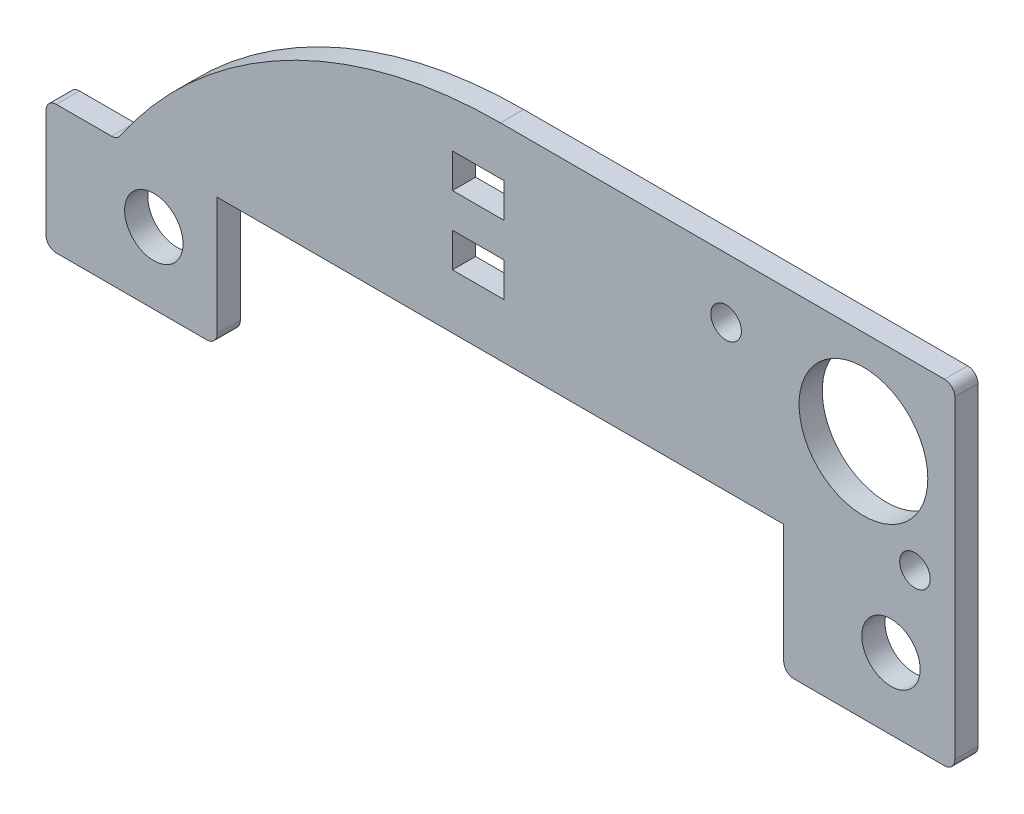
ISO-10303-21;
HEADER;
FILE_DESCRIPTION(('STEP AP214'),'2;1');
FILE_NAME('part.step','',(''),(''),'','','');
FILE_SCHEMA(('AUTOMOTIVE_DESIGN { 1 0 10303 214 1 1 1 1 }'));
ENDSEC;
DATA;
#1=APPLICATION_CONTEXT('core data for automotive mechanical design processes');
#2=APPLICATION_PROTOCOL_DEFINITION('international standard','automotive_design',2000,#1);
#3=PRODUCT_CONTEXT('',#1,'mechanical');
#4=PRODUCT('Part','Part','',(#3));
#5=PRODUCT_RELATED_PRODUCT_CATEGORY('part','',(#4));
#6=PRODUCT_DEFINITION_FORMATION('','',#4);
#7=PRODUCT_DEFINITION_CONTEXT('part definition',#1,'design');
#8=PRODUCT_DEFINITION('design','',#6,#7);
#9=PRODUCT_DEFINITION_SHAPE('','',#8);
#10=(LENGTH_UNIT() NAMED_UNIT(*) SI_UNIT(.MILLI.,.METRE.));
#11=(NAMED_UNIT(*) PLANE_ANGLE_UNIT() SI_UNIT($,.RADIAN.));
#12=(NAMED_UNIT(*) SI_UNIT($,.STERADIAN.) SOLID_ANGLE_UNIT());
#13=UNCERTAINTY_MEASURE_WITH_UNIT(LENGTH_MEASURE(1.E-05),#10,'distance_accuracy_value','');
#14=(GEOMETRIC_REPRESENTATION_CONTEXT(3) GLOBAL_UNCERTAINTY_ASSIGNED_CONTEXT((#13)) GLOBAL_UNIT_ASSIGNED_CONTEXT((#10,
#11,#12)) REPRESENTATION_CONTEXT('',''));
#15=CARTESIAN_POINT('',(0.,0.,0.));
#16=DIRECTION('',(0.,0.,1.));
#17=DIRECTION('',(1.,0.,0.));
#18=AXIS2_PLACEMENT_3D('',#15,#16,#17);
#19=CARTESIAN_POINT('',(-33.613,9.24499999999995,1.7145));
#20=DIRECTION('',(0.,1.,0.));
#21=DIRECTION('',(-1.,0.,0.));
#22=AXIS2_PLACEMENT_3D('',#19,#20,#21);
#23=PLANE('',#22);
#24=DIRECTION('',(1.,0.,0.));
#25=VECTOR('',#24,1.);
#26=CARTESIAN_POINT('',(-33.613,9.24499999999995,0.));
#27=LINE('',#26,#25);
#28=CARTESIAN_POINT('',(-32.851,9.24499999999995,0.));
#29=VERTEX_POINT('',#28);
#30=CARTESIAN_POINT('',(-21.717,9.24499999999995,0.));
#31=VERTEX_POINT('',#30);
#32=EDGE_CURVE('E348',#29,#31,#27,.T.);
#33=ORIENTED_EDGE('',*,*,#32,.T.);
#34=DIRECTION('',(0.,0.,1.));
#35=VECTOR('',#34,1.);
#36=CARTESIAN_POINT('',(-21.717,9.24499999999995,1.7145));
#37=LINE('',#36,#35);
#38=CARTESIAN_POINT('',(-21.717,9.24499999999995,1.7145));
#39=VERTEX_POINT('',#38);
#40=EDGE_CURVE('E389',#31,#39,#37,.T.);
#41=ORIENTED_EDGE('',*,*,#40,.T.);
#42=DIRECTION('',(1.,0.,0.));
#43=VECTOR('',#42,1.);
#44=CARTESIAN_POINT('',(-33.613,9.24499999999995,1.7145));
#45=LINE('',#44,#43);
#46=CARTESIAN_POINT('',(-32.851,9.24499999999995,1.7145));
#47=VERTEX_POINT('',#46);
#48=EDGE_CURVE('E330',#47,#39,#45,.T.);
#49=ORIENTED_EDGE('',*,*,#48,.F.);
#50=DIRECTION('',(0.,0.,-1.));
#51=VECTOR('',#50,1.);
#52=CARTESIAN_POINT('',(-32.851,9.24499999999995,1.7145));
#53=LINE('',#52,#51);
#54=EDGE_CURVE('E386',#47,#29,#53,.T.);
#55=ORIENTED_EDGE('',*,*,#54,.T.);
#56=EDGE_LOOP('',(#33,#41,#49,#55));
#57=FACE_BOUND('',#56,.T.);
#58=ADVANCED_FACE('F33',(#57),#23,.F.);
#59=CARTESIAN_POINT('',(0.,0.,1.7145));
#60=DIRECTION('',(0.,0.,1.));
#61=DIRECTION('',(1.,0.,0.));
#62=AXIS2_PLACEMENT_3D('',#59,#60,#61);
#63=PLANE('',#62);
#64=DIRECTION('',(0.,1.,0.));
#65=VECTOR('',#64,1.);
#66=CARTESIAN_POINT('',(20.955,18.7699999999999,1.7145));
#67=LINE('',#66,#65);
#68=CARTESIAN_POINT('',(20.955,10.0069999999999,1.7145));
#69=VERTEX_POINT('',#68);
#70=CARTESIAN_POINT('',(20.955,18.7699999999999,1.7145));
#71=VERTEX_POINT('',#70);
#72=EDGE_CURVE('E202',#69,#71,#67,.T.);
#73=ORIENTED_EDGE('',*,*,#72,.F.);
#74=CARTESIAN_POINT('',(21.717,10.0069999999999,1.7145));
#75=DIRECTION('',(0.,0.,1.));
#76=DIRECTION('',(1.,0.,0.));
#77=AXIS2_PLACEMENT_3D('',#74,#75,#76);
#78=CIRCLE('',#77,0.762);
#79=CARTESIAN_POINT('',(21.717,9.24499999999995,1.7145));
#80=VERTEX_POINT('',#79);
#81=EDGE_CURVE('E370',#69,#80,#78,.T.);
#82=ORIENTED_EDGE('',*,*,#81,.T.);
#83=CARTESIAN_POINT('',(32.851,9.24499999999995,1.7145));
#84=VERTEX_POINT('',#83);
#85=EDGE_CURVE('E329',#80,#84,#45,.T.);
#86=ORIENTED_EDGE('',*,*,#85,.T.);
#87=CARTESIAN_POINT('',(32.851,10.0069999999999,1.7145));
#88=DIRECTION('',(0.,0.,1.));
#89=DIRECTION('',(1.,0.,0.));
#90=AXIS2_PLACEMENT_3D('',#87,#88,#89);
#91=CIRCLE('',#90,0.762);
#92=CARTESIAN_POINT('',(33.613,10.007,1.7145));
#93=VERTEX_POINT('',#92);
#94=EDGE_CURVE('E364',#84,#93,#91,.T.);
#95=ORIENTED_EDGE('',*,*,#94,.T.);
#96=DIRECTION('',(0.,1.,0.));
#97=VECTOR('',#96,1.);
#98=CARTESIAN_POINT('',(33.613,34.0099999999999,1.7145));
#99=LINE('',#98,#97);
#100=CARTESIAN_POINT('',(33.613,33.2479999999999,1.7145));
#101=VERTEX_POINT('',#100);
#102=EDGE_CURVE('E333',#93,#101,#99,.T.);
#103=ORIENTED_EDGE('',*,*,#102,.T.);
#104=CARTESIAN_POINT('',(32.851,33.2479999999999,1.7145));
#105=DIRECTION('',(0.,0.,1.));
#106=DIRECTION('',(1.,0.,0.));
#107=AXIS2_PLACEMENT_3D('',#104,#105,#106);
#108=CIRCLE('',#107,0.762);
#109=CARTESIAN_POINT('',(32.851,34.0099999999999,1.7145));
#110=VERTEX_POINT('',#109);
#111=EDGE_CURVE('E366',#101,#110,#108,.T.);
#112=ORIENTED_EDGE('',*,*,#111,.T.);
#113=DIRECTION('',(-1.,0.,0.));
#114=VECTOR('',#113,1.);
#115=CARTESIAN_POINT('',(33.613,34.0099999999999,1.7145));
#116=LINE('',#115,#114);
#117=CARTESIAN_POINT('',(0.,34.0099999999999,1.7145));
#118=VERTEX_POINT('',#117);
#119=EDGE_CURVE('E336',#110,#118,#116,.T.);
#120=ORIENTED_EDGE('',*,*,#119,.T.);
#121=CARTESIAN_POINT('',(0.,0.,1.7145));
#122=DIRECTION('',(0.,0.,1.));
#123=DIRECTION('',(1.,0.,0.));
#124=AXIS2_PLACEMENT_3D('',#121,#122,#123);
#125=CIRCLE('',#124,34.0099999999999);
#126=CARTESIAN_POINT('',(-28.1374900737837,19.1039721615092,1.7145));
#127=VERTEX_POINT('',#126);
#128=EDGE_CURVE('E338',#118,#127,#125,.T.);
#129=ORIENTED_EDGE('',*,*,#128,.T.);
#130=CARTESIAN_POINT('',(-28.7679154614998,19.5319999999999,1.7145));
#131=DIRECTION('',(0.,0.,1.));
#132=DIRECTION('',(1.,0.,0.));
#133=AXIS2_PLACEMENT_3D('',#130,#131,#132);
#134=CIRCLE('',#133,0.762);
#135=CARTESIAN_POINT('',(-28.7679154614998,18.7699999999999,1.7145));
#136=VERTEX_POINT('',#135);
#137=EDGE_CURVE('E11',#127,#136,#134,.F.);
#138=ORIENTED_EDGE('',*,*,#137,.T.);
#139=DIRECTION('',(-1.,0.,0.));
#140=VECTOR('',#139,1.);
#141=CARTESIAN_POINT('',(-33.613,18.7699999999999,1.7145));
#142=LINE('',#141,#140);
#143=CARTESIAN_POINT('',(-32.851,18.7699999999999,1.7145));
#144=VERTEX_POINT('',#143);
#145=EDGE_CURVE('E322',#136,#144,#142,.T.);
#146=ORIENTED_EDGE('',*,*,#145,.T.);
#147=CARTESIAN_POINT('',(-32.851,18.0079999999999,1.7145));
#148=DIRECTION('',(0.,0.,1.));
#149=DIRECTION('',(1.,0.,0.));
#150=AXIS2_PLACEMENT_3D('',#147,#148,#149);
#151=CIRCLE('',#150,0.762);
#152=CARTESIAN_POINT('',(-33.613,18.0079999999999,1.7145));
#153=VERTEX_POINT('',#152);
#154=EDGE_CURVE('E360',#144,#153,#151,.T.);
#155=ORIENTED_EDGE('',*,*,#154,.T.);
#156=DIRECTION('',(0.,-1.,0.));
#157=VECTOR('',#156,1.);
#158=CARTESIAN_POINT('',(-33.613,18.7699999999999,1.7145));
#159=LINE('',#158,#157);
#160=CARTESIAN_POINT('',(-33.613,10.0069999999999,1.7145));
#161=VERTEX_POINT('',#160);
#162=EDGE_CURVE('E325',#153,#161,#159,.T.);
#163=ORIENTED_EDGE('',*,*,#162,.T.);
#164=CARTESIAN_POINT('',(-32.851,10.0069999999999,1.7145));
#165=DIRECTION('',(0.,0.,1.));
#166=DIRECTION('',(1.,0.,0.));
#167=AXIS2_PLACEMENT_3D('',#164,#165,#166);
#168=CIRCLE('',#167,0.762);
#169=EDGE_CURVE('E362',#161,#47,#168,.T.);
#170=ORIENTED_EDGE('',*,*,#169,.T.);
#171=ORIENTED_EDGE('',*,*,#48,.T.);
#172=CARTESIAN_POINT('',(-21.717,10.0069999999999,1.7145));
#173=DIRECTION('',(0.,0.,1.));
#174=DIRECTION('',(1.,0.,0.));
#175=AXIS2_PLACEMENT_3D('',#172,#173,#174);
#176=CIRCLE('',#175,0.762);
#177=CARTESIAN_POINT('',(-20.955,10.0069999999999,1.7145));
#178=VERTEX_POINT('',#177);
#179=EDGE_CURVE('E368',#39,#178,#176,.T.);
#180=ORIENTED_EDGE('',*,*,#179,.T.);
#181=DIRECTION('',(0.,-1.,0.));
#182=VECTOR('',#181,1.);
#183=CARTESIAN_POINT('',(-20.955,18.7699999999999,1.7145));
#184=LINE('',#183,#182);
#185=CARTESIAN_POINT('',(-20.955,18.7699999999999,1.7145));
#186=VERTEX_POINT('',#185);
#187=EDGE_CURVE('E213',#186,#178,#184,.T.);
#188=ORIENTED_EDGE('',*,*,#187,.F.);
#189=DIRECTION('',(-1.,0.,0.));
#190=VECTOR('',#189,1.);
#191=CARTESIAN_POINT('',(-20.955,18.7699999999999,1.7145));
#192=LINE('',#191,#190);
#193=EDGE_CURVE('E212',#71,#186,#192,.T.);
#194=ORIENTED_EDGE('',*,*,#193,.F.);
#195=EDGE_LOOP('',(#73,#82,#86,#95,#103,#112,#120,#129,#138,#146,#155,#163,#170,#171,#180,#188,#194));
#196=FACE_BOUND('',#195,.T.);
#197=DIRECTION('',(0.,-1.,0.));
#198=VECTOR('',#197,1.);
#199=CARTESIAN_POINT('',(-3.54914079696229,30.4366725441909,1.7145));
#200=LINE('',#199,#198);
#201=CARTESIAN_POINT('',(-3.54914079696229,30.4366725441909,1.7145));
#202=VERTEX_POINT('',#201);
#203=CARTESIAN_POINT('',(-3.54914079696229,27.8966725441909,1.7145));
#204=VERTEX_POINT('',#203);
#205=EDGE_CURVE('E241',#202,#204,#200,.T.);
#206=ORIENTED_EDGE('',*,*,#205,.F.);
#207=DIRECTION('',(-1.,0.,0.));
#208=VECTOR('',#207,1.);
#209=CARTESIAN_POINT('',(-3.54914079696229,30.4366725441909,1.7145));
#210=LINE('',#209,#208);
#211=CARTESIAN_POINT('',(0.260859203037711,30.4366725441909,1.7145));
#212=VERTEX_POINT('',#211);
#213=EDGE_CURVE('E250',#212,#202,#210,.T.);
#214=ORIENTED_EDGE('',*,*,#213,.F.);
#215=DIRECTION('',(0.,1.,0.));
#216=VECTOR('',#215,1.);
#217=CARTESIAN_POINT('',(0.260859203037711,30.4366725441909,1.7145));
#218=LINE('',#217,#216);
#219=CARTESIAN_POINT('',(0.260859203037709,27.8966725441909,1.7145));
#220=VERTEX_POINT('',#219);
#221=EDGE_CURVE('E247',#220,#212,#218,.T.);
#222=ORIENTED_EDGE('',*,*,#221,.F.);
#223=DIRECTION('',(1.,0.,0.));
#224=VECTOR('',#223,1.);
#225=CARTESIAN_POINT('',(-3.54914079696229,27.8966725441909,1.7145));
#226=LINE('',#225,#224);
#227=EDGE_CURVE('E243',#204,#220,#226,.T.);
#228=ORIENTED_EDGE('',*,*,#227,.F.);
#229=EDGE_LOOP('',(#206,#214,#222,#228));
#230=FACE_BOUND('',#229,.T.);
#231=DIRECTION('',(0.,-1.,0.));
#232=VECTOR('',#231,1.);
#233=CARTESIAN_POINT('',(-3.54914079696229,25.3566725441909,1.7145));
#234=LINE('',#233,#232);
#235=CARTESIAN_POINT('',(-3.54914079696229,25.3566725441909,1.7145));
#236=VERTEX_POINT('',#235);
#237=CARTESIAN_POINT('',(-3.54914079696229,22.8166725441909,1.7145));
#238=VERTEX_POINT('',#237);
#239=EDGE_CURVE('E271',#236,#238,#234,.T.);
#240=ORIENTED_EDGE('',*,*,#239,.F.);
#241=DIRECTION('',(-1.,0.,0.));
#242=VECTOR('',#241,1.);
#243=CARTESIAN_POINT('',(-3.54914079696229,25.3566725441909,1.7145));
#244=LINE('',#243,#242);
#245=CARTESIAN_POINT('',(0.260859203037713,25.3566725441909,1.7145));
#246=VERTEX_POINT('',#245);
#247=EDGE_CURVE('E280',#246,#236,#244,.T.);
#248=ORIENTED_EDGE('',*,*,#247,.F.);
#249=DIRECTION('',(0.,1.,0.));
#250=VECTOR('',#249,1.);
#251=CARTESIAN_POINT('',(0.260859203037713,25.3566725441909,1.7145));
#252=LINE('',#251,#250);
#253=CARTESIAN_POINT('',(0.260859203037712,22.8166725441909,1.7145));
#254=VERTEX_POINT('',#253);
#255=EDGE_CURVE('E277',#254,#246,#252,.T.);
#256=ORIENTED_EDGE('',*,*,#255,.F.);
#257=DIRECTION('',(1.,0.,0.));
#258=VECTOR('',#257,1.);
#259=CARTESIAN_POINT('',(-3.54914079696229,22.8166725441909,1.7145));
#260=LINE('',#259,#258);
#261=EDGE_CURVE('E273',#238,#254,#260,.T.);
#262=ORIENTED_EDGE('',*,*,#261,.F.);
#263=EDGE_LOOP('',(#240,#248,#256,#262));
#264=FACE_BOUND('',#263,.T.);
#265=CARTESIAN_POINT('',(16.6925888348737,29.565,1.7145));
#266=DIRECTION('',(0.,0.,1.));
#267=DIRECTION('',(1.,0.,0.));
#268=AXIS2_PLACEMENT_3D('',#265,#266,#267);
#269=CIRCLE('',#268,1.1303);
#270=CARTESIAN_POINT('',(17.8228888348737,29.565,1.7145));
#271=VERTEX_POINT('',#270);
#272=EDGE_CURVE('E298',#271,#271,#269,.T.);
#273=ORIENTED_EDGE('',*,*,#272,.F.);
#274=EDGE_LOOP('',(#273));
#275=FACE_BOUND('',#274,.T.);
#276=CARTESIAN_POINT('',(28.8886,14.5155,1.7145));
#277=DIRECTION('',(0.,0.,1.));
#278=DIRECTION('',(1.,0.,0.));
#279=AXIS2_PLACEMENT_3D('',#276,#277,#278);
#280=CIRCLE('',#279,2.159);
#281=CARTESIAN_POINT('',(31.0476,14.5155,1.7145));
#282=VERTEX_POINT('',#281);
#283=EDGE_CURVE('E310',#282,#282,#280,.T.);
#284=ORIENTED_EDGE('',*,*,#283,.F.);
#285=EDGE_LOOP('',(#284));
#286=FACE_BOUND('',#285,.T.);
#287=CARTESIAN_POINT('',(-25.6374,14.5154999999999,1.7145));
#288=DIRECTION('',(0.,0.,1.));
#289=DIRECTION('',(1.,0.,0.));
#290=AXIS2_PLACEMENT_3D('',#287,#288,#289);
#291=CIRCLE('',#290,2.159);
#292=CARTESIAN_POINT('',(-23.4784,14.5154999999999,1.7145));
#293=VERTEX_POINT('',#292);
#294=EDGE_CURVE('E316',#293,#293,#291,.T.);
#295=ORIENTED_EDGE('',*,*,#294,.F.);
#296=EDGE_LOOP('',(#295));
#297=FACE_BOUND('',#296,.T.);
#298=CARTESIAN_POINT('',(30.6625888348737,20.675,1.7145));
#299=DIRECTION('',(0.,0.,1.));
#300=DIRECTION('',(1.,0.,0.));
#301=AXIS2_PLACEMENT_3D('',#298,#299,#300);
#302=CIRCLE('',#301,1.13030000000001);
#303=CARTESIAN_POINT('',(31.7928888348737,20.675,1.7145));
#304=VERTEX_POINT('',#303);
#305=EDGE_CURVE('E304',#304,#304,#302,.T.);
#306=ORIENTED_EDGE('',*,*,#305,.F.);
#307=EDGE_LOOP('',(#306));
#308=FACE_BOUND('',#307,.T.);
#309=CARTESIAN_POINT('',(26.8525888348737,27.025,1.7145));
#310=DIRECTION('',(0.,0.,1.));
#311=DIRECTION('',(1.,0.,0.));
#312=AXIS2_PLACEMENT_3D('',#309,#310,#311);
#313=CIRCLE('',#312,4.76250000000001);
#314=CARTESIAN_POINT('',(31.6150888348737,27.025,1.7145));
#315=VERTEX_POINT('',#314);
#316=EDGE_CURVE('E292',#315,#315,#313,.T.);
#317=ORIENTED_EDGE('',*,*,#316,.F.);
#318=EDGE_LOOP('',(#317));
#319=FACE_BOUND('',#318,.T.);
#320=ADVANCED_FACE('F224',(#196,#230,#264,#275,#286,#297,#308,#319),#63,.T.);
#321=CARTESIAN_POINT('',(0.,0.,0.));
#322=DIRECTION('',(0.,0.,1.));
#323=DIRECTION('',(1.,0.,0.));
#324=AXIS2_PLACEMENT_3D('',#321,#322,#323);
#325=PLANE('',#324);
#326=DIRECTION('',(1.,0.,0.));
#327=VECTOR('',#326,1.);
#328=CARTESIAN_POINT('',(-3.54914079696229,30.4366725441909,0.));
#329=LINE('',#328,#327);
#330=CARTESIAN_POINT('',(-3.54914079696229,30.4366725441909,0.));
#331=VERTEX_POINT('',#330);
#332=CARTESIAN_POINT('',(0.260859203037711,30.4366725441909,0.));
#333=VERTEX_POINT('',#332);
#334=EDGE_CURVE('E235',#331,#333,#329,.T.);
#335=ORIENTED_EDGE('',*,*,#334,.F.);
#336=DIRECTION('',(0.,1.,0.));
#337=VECTOR('',#336,1.);
#338=CARTESIAN_POINT('',(-3.54914079696229,30.4366725441909,0.));
#339=LINE('',#338,#337);
#340=CARTESIAN_POINT('',(-3.54914079696229,27.8966725441909,0.));
#341=VERTEX_POINT('',#340);
#342=EDGE_CURVE('E238',#341,#331,#339,.T.);
#343=ORIENTED_EDGE('',*,*,#342,.F.);
#344=DIRECTION('',(-1.,0.,0.));
#345=VECTOR('',#344,1.);
#346=CARTESIAN_POINT('',(-3.54914079696229,27.8966725441909,0.));
#347=LINE('',#346,#345);
#348=CARTESIAN_POINT('',(0.260859203037709,27.8966725441909,0.));
#349=VERTEX_POINT('',#348);
#350=EDGE_CURVE('E240',#349,#341,#347,.T.);
#351=ORIENTED_EDGE('',*,*,#350,.F.);
#352=DIRECTION('',(0.,-1.,0.));
#353=VECTOR('',#352,1.);
#354=CARTESIAN_POINT('',(0.260859203037711,30.4366725441909,0.));
#355=LINE('',#354,#353);
#356=EDGE_CURVE('E232',#333,#349,#355,.T.);
#357=ORIENTED_EDGE('',*,*,#356,.F.);
#358=EDGE_LOOP('',(#335,#343,#351,#357));
#359=FACE_BOUND('',#358,.T.);
#360=DIRECTION('',(1.,0.,0.));
#361=VECTOR('',#360,1.);
#362=CARTESIAN_POINT('',(-3.54914079696229,25.3566725441909,0.));
#363=LINE('',#362,#361);
#364=CARTESIAN_POINT('',(-3.54914079696229,25.3566725441909,0.));
#365=VERTEX_POINT('',#364);
#366=CARTESIAN_POINT('',(0.260859203037713,25.3566725441909,0.));
#367=VERTEX_POINT('',#366);
#368=EDGE_CURVE('E266',#365,#367,#363,.T.);
#369=ORIENTED_EDGE('',*,*,#368,.F.);
#370=DIRECTION('',(0.,1.,0.));
#371=VECTOR('',#370,1.);
#372=CARTESIAN_POINT('',(-3.54914079696229,25.3566725441909,0.));
#373=LINE('',#372,#371);
#374=CARTESIAN_POINT('',(-3.54914079696229,22.8166725441909,0.));
#375=VERTEX_POINT('',#374);
#376=EDGE_CURVE('E269',#375,#365,#373,.T.);
#377=ORIENTED_EDGE('',*,*,#376,.F.);
#378=DIRECTION('',(-1.,0.,0.));
#379=VECTOR('',#378,1.);
#380=CARTESIAN_POINT('',(-3.54914079696229,22.8166725441909,0.));
#381=LINE('',#380,#379);
#382=CARTESIAN_POINT('',(0.260859203037712,22.8166725441909,0.));
#383=VERTEX_POINT('',#382);
#384=EDGE_CURVE('E244',#383,#375,#381,.T.);
#385=ORIENTED_EDGE('',*,*,#384,.F.);
#386=DIRECTION('',(0.,-1.,0.));
#387=VECTOR('',#386,1.);
#388=CARTESIAN_POINT('',(0.260859203037713,25.3566725441909,0.));
#389=LINE('',#388,#387);
#390=EDGE_CURVE('E263',#367,#383,#389,.T.);
#391=ORIENTED_EDGE('',*,*,#390,.F.);
#392=EDGE_LOOP('',(#369,#377,#385,#391));
#393=FACE_BOUND('',#392,.T.);
#394=CARTESIAN_POINT('',(21.717,9.24499999999995,0.));
#395=VERTEX_POINT('',#394);
#396=CARTESIAN_POINT('',(32.851,9.24499999999995,0.));
#397=VERTEX_POINT('',#396);
#398=EDGE_CURVE('E347',#395,#397,#27,.T.);
#399=ORIENTED_EDGE('',*,*,#398,.F.);
#400=CARTESIAN_POINT('',(21.717,10.0069999999999,0.));
#401=DIRECTION('',(0.,0.,1.));
#402=DIRECTION('',(1.,0.,0.));
#403=AXIS2_PLACEMENT_3D('',#400,#401,#402);
#404=CIRCLE('',#403,0.762);
#405=CARTESIAN_POINT('',(20.955,10.0069999999999,0.));
#406=VERTEX_POINT('',#405);
#407=EDGE_CURVE('E384',#395,#406,#404,.F.);
#408=ORIENTED_EDGE('',*,*,#407,.T.);
#409=DIRECTION('',(0.,-1.,0.));
#410=VECTOR('',#409,1.);
#411=CARTESIAN_POINT('',(20.955,18.7699999999999,0.));
#412=LINE('',#411,#410);
#413=CARTESIAN_POINT('',(20.955,18.7699999999999,0.));
#414=VERTEX_POINT('',#413);
#415=EDGE_CURVE('E230',#414,#406,#412,.T.);
#416=ORIENTED_EDGE('',*,*,#415,.F.);
#417=DIRECTION('',(1.,0.,0.));
#418=VECTOR('',#417,1.);
#419=CARTESIAN_POINT('',(-20.955,18.7699999999999,0.));
#420=LINE('',#419,#418);
#421=CARTESIAN_POINT('',(-20.955,18.7699999999999,0.));
#422=VERTEX_POINT('',#421);
#423=EDGE_CURVE('E221',#422,#414,#420,.T.);
#424=ORIENTED_EDGE('',*,*,#423,.F.);
#425=DIRECTION('',(0.,1.,0.));
#426=VECTOR('',#425,1.);
#427=CARTESIAN_POINT('',(-20.955,18.7699999999999,0.));
#428=LINE('',#427,#426);
#429=CARTESIAN_POINT('',(-20.955,10.0069999999999,0.));
#430=VERTEX_POINT('',#429);
#431=EDGE_CURVE('E274',#430,#422,#428,.T.);
#432=ORIENTED_EDGE('',*,*,#431,.F.);
#433=CARTESIAN_POINT('',(-21.717,10.0069999999999,0.));
#434=DIRECTION('',(0.,0.,1.));
#435=DIRECTION('',(1.,0.,0.));
#436=AXIS2_PLACEMENT_3D('',#433,#434,#435);
#437=CIRCLE('',#436,0.762);
#438=EDGE_CURVE('E382',#430,#31,#437,.F.);
#439=ORIENTED_EDGE('',*,*,#438,.T.);
#440=ORIENTED_EDGE('',*,*,#32,.F.);
#441=CARTESIAN_POINT('',(-32.851,10.0069999999999,0.));
#442=DIRECTION('',(0.,0.,1.));
#443=DIRECTION('',(1.,0.,0.));
#444=AXIS2_PLACEMENT_3D('',#441,#442,#443);
#445=CIRCLE('',#444,0.762);
#446=CARTESIAN_POINT('',(-33.613,10.0069999999999,0.));
#447=VERTEX_POINT('',#446);
#448=EDGE_CURVE('E378',#29,#447,#445,.F.);
#449=ORIENTED_EDGE('',*,*,#448,.T.);
#450=DIRECTION('',(0.,-1.,0.));
#451=VECTOR('',#450,1.);
#452=CARTESIAN_POINT('',(-33.613,18.7699999999999,0.));
#453=LINE('',#452,#451);
#454=CARTESIAN_POINT('',(-33.613,18.0079999999999,0.));
#455=VERTEX_POINT('',#454);
#456=EDGE_CURVE('E344',#455,#447,#453,.T.);
#457=ORIENTED_EDGE('',*,*,#456,.F.);
#458=CARTESIAN_POINT('',(-32.851,18.0079999999999,0.));
#459=DIRECTION('',(0.,0.,1.));
#460=DIRECTION('',(1.,0.,0.));
#461=AXIS2_PLACEMENT_3D('',#458,#459,#460);
#462=CIRCLE('',#461,0.762);
#463=CARTESIAN_POINT('',(-32.851,18.7699999999999,0.));
#464=VERTEX_POINT('',#463);
#465=EDGE_CURVE('E376',#455,#464,#462,.F.);
#466=ORIENTED_EDGE('',*,*,#465,.T.);
#467=DIRECTION('',(-1.,0.,0.));
#468=VECTOR('',#467,1.);
#469=CARTESIAN_POINT('',(-33.613,18.7699999999999,0.));
#470=LINE('',#469,#468);
#471=CARTESIAN_POINT('',(-28.7679154614998,18.7699999999999,0.));
#472=VERTEX_POINT('',#471);
#473=EDGE_CURVE('E319',#472,#464,#470,.T.);
#474=ORIENTED_EDGE('',*,*,#473,.F.);
#475=CARTESIAN_POINT('',(-28.7679154614998,19.5319999999999,0.));
#476=DIRECTION('',(0.,0.,1.));
#477=DIRECTION('',(1.,0.,0.));
#478=AXIS2_PLACEMENT_3D('',#475,#476,#477);
#479=CIRCLE('',#478,0.762);
#480=CARTESIAN_POINT('',(-28.1374900737837,19.1039721615092,0.));
#481=VERTEX_POINT('',#480);
#482=EDGE_CURVE('E41',#472,#481,#479,.T.);
#483=ORIENTED_EDGE('',*,*,#482,.T.);
#484=CARTESIAN_POINT('',(0.,0.,0.));
#485=DIRECTION('',(0.,0.,1.));
#486=DIRECTION('',(1.,0.,0.));
#487=AXIS2_PLACEMENT_3D('',#484,#485,#486);
#488=CIRCLE('',#487,34.0099999999999);
#489=CARTESIAN_POINT('',(0.,34.0099999999999,0.));
#490=VERTEX_POINT('',#489);
#491=EDGE_CURVE('E326',#490,#481,#488,.T.);
#492=ORIENTED_EDGE('',*,*,#491,.F.);
#493=DIRECTION('',(-1.,0.,0.));
#494=VECTOR('',#493,1.);
#495=CARTESIAN_POINT('',(33.613,34.0099999999999,0.));
#496=LINE('',#495,#494);
#497=CARTESIAN_POINT('',(32.851,34.0099999999999,0.));
#498=VERTEX_POINT('',#497);
#499=EDGE_CURVE('E353',#498,#490,#496,.T.);
#500=ORIENTED_EDGE('',*,*,#499,.F.);
#501=CARTESIAN_POINT('',(32.851,33.2479999999999,0.));
#502=DIRECTION('',(0.,0.,1.));
#503=DIRECTION('',(1.,0.,0.));
#504=AXIS2_PLACEMENT_3D('',#501,#502,#503);
#505=CIRCLE('',#504,0.762);
#506=CARTESIAN_POINT('',(33.613,33.2479999999999,0.));
#507=VERTEX_POINT('',#506);
#508=EDGE_CURVE('E48',#498,#507,#505,.F.);
#509=ORIENTED_EDGE('',*,*,#508,.T.);
#510=DIRECTION('',(0.,1.,0.));
#511=VECTOR('',#510,1.);
#512=CARTESIAN_POINT('',(33.613,34.0099999999999,0.));
#513=LINE('',#512,#511);
#514=CARTESIAN_POINT('',(33.613,10.007,0.));
#515=VERTEX_POINT('',#514);
#516=EDGE_CURVE('E351',#515,#507,#513,.T.);
#517=ORIENTED_EDGE('',*,*,#516,.F.);
#518=CARTESIAN_POINT('',(32.851,10.0069999999999,0.));
#519=DIRECTION('',(0.,0.,1.));
#520=DIRECTION('',(1.,0.,0.));
#521=AXIS2_PLACEMENT_3D('',#518,#519,#520);
#522=CIRCLE('',#521,0.762);
#523=EDGE_CURVE('E56',#515,#397,#522,.F.);
#524=ORIENTED_EDGE('',*,*,#523,.T.);
#525=EDGE_LOOP('',(#399,#408,#416,#424,#432,#439,#440,#449,#457,#466,#474,#483,#492,#500,#509,
#517,#524));
#526=FACE_BOUND('',#525,.T.);
#527=CARTESIAN_POINT('',(-25.6374,14.5154999999999,0.));
#528=DIRECTION('',(0.,0.,1.));
#529=DIRECTION('',(1.,0.,0.));
#530=AXIS2_PLACEMENT_3D('',#527,#528,#529);
#531=CIRCLE('',#530,2.159);
#532=CARTESIAN_POINT('',(-23.4784,14.5154999999999,0.));
#533=VERTEX_POINT('',#532);
#534=EDGE_CURVE('E313',#533,#533,#531,.T.);
#535=ORIENTED_EDGE('',*,*,#534,.T.);
#536=EDGE_LOOP('',(#535));
#537=FACE_BOUND('',#536,.T.);
#538=CARTESIAN_POINT('',(28.8886,14.5155,0.));
#539=DIRECTION('',(0.,0.,1.));
#540=DIRECTION('',(1.,0.,0.));
#541=AXIS2_PLACEMENT_3D('',#538,#539,#540);
#542=CIRCLE('',#541,2.159);
#543=CARTESIAN_POINT('',(31.0476,14.5155,0.));
#544=VERTEX_POINT('',#543);
#545=EDGE_CURVE('E307',#544,#544,#542,.T.);
#546=ORIENTED_EDGE('',*,*,#545,.T.);
#547=EDGE_LOOP('',(#546));
#548=FACE_BOUND('',#547,.T.);
#549=CARTESIAN_POINT('',(30.6625888348737,20.675,0.));
#550=DIRECTION('',(0.,0.,1.));
#551=DIRECTION('',(1.,0.,0.));
#552=AXIS2_PLACEMENT_3D('',#549,#550,#551);
#553=CIRCLE('',#552,1.13030000000001);
#554=CARTESIAN_POINT('',(31.7928888348737,20.675,0.));
#555=VERTEX_POINT('',#554);
#556=EDGE_CURVE('E301',#555,#555,#553,.T.);
#557=ORIENTED_EDGE('',*,*,#556,.T.);
#558=EDGE_LOOP('',(#557));
#559=FACE_BOUND('',#558,.T.);
#560=CARTESIAN_POINT('',(16.6925888348737,29.565,0.));
#561=DIRECTION('',(0.,0.,1.));
#562=DIRECTION('',(1.,0.,0.));
#563=AXIS2_PLACEMENT_3D('',#560,#561,#562);
#564=CIRCLE('',#563,1.1303);
#565=CARTESIAN_POINT('',(17.8228888348737,29.565,0.));
#566=VERTEX_POINT('',#565);
#567=EDGE_CURVE('E295',#566,#566,#564,.T.);
#568=ORIENTED_EDGE('',*,*,#567,.T.);
#569=EDGE_LOOP('',(#568));
#570=FACE_BOUND('',#569,.T.);
#571=CARTESIAN_POINT('',(26.8525888348737,27.025,0.));
#572=DIRECTION('',(0.,0.,1.));
#573=DIRECTION('',(1.,0.,0.));
#574=AXIS2_PLACEMENT_3D('',#571,#572,#573);
#575=CIRCLE('',#574,4.76250000000001);
#576=CARTESIAN_POINT('',(31.6150888348737,27.025,0.));
#577=VERTEX_POINT('',#576);
#578=EDGE_CURVE('E262',#577,#577,#575,.T.);
#579=ORIENTED_EDGE('',*,*,#578,.T.);
#580=EDGE_LOOP('',(#579));
#581=FACE_BOUND('',#580,.T.);
#582=ADVANCED_FACE('F415',(#359,#393,#526,#537,#548,#559,#570,#581),#325,.F.);
#583=CARTESIAN_POINT('',(-33.613,18.7699999999999,1.7145));
#584=DIRECTION('',(0.,-1.,0.));
#585=DIRECTION('',(1.,0.,0.));
#586=AXIS2_PLACEMENT_3D('',#583,#584,#585);
#587=PLANE('',#586);
#588=ORIENTED_EDGE('',*,*,#145,.F.);
#589=DIRECTION('',(0.,0.,1.));
#590=VECTOR('',#589,1.);
#591=CARTESIAN_POINT('',(-28.7679154614998,18.7699999999999,0.));
#592=LINE('',#591,#590);
#593=EDGE_CURVE('E408',#136,#472,#592,.F.);
#594=ORIENTED_EDGE('',*,*,#593,.T.);
#595=ORIENTED_EDGE('',*,*,#473,.T.);
#596=DIRECTION('',(0.,0.,-1.));
#597=VECTOR('',#596,1.);
#598=CARTESIAN_POINT('',(-32.851,18.7699999999999,1.7145));
#599=LINE('',#598,#597);
#600=EDGE_CURVE('E406',#464,#144,#599,.F.);
#601=ORIENTED_EDGE('',*,*,#600,.T.);
#602=EDGE_LOOP('',(#588,#594,#595,#601));
#603=FACE_BOUND('',#602,.T.);
#604=ADVANCED_FACE('F429',(#603),#587,.F.);
#605=CARTESIAN_POINT('',(-33.613,18.7699999999999,1.7145));
#606=DIRECTION('',(1.,0.,0.));
#607=DIRECTION('',(0.,0.,-1.));
#608=AXIS2_PLACEMENT_3D('',#605,#606,#607);
#609=PLANE('',#608);
#610=ORIENTED_EDGE('',*,*,#456,.T.);
#611=DIRECTION('',(0.,0.,-1.));
#612=VECTOR('',#611,1.);
#613=CARTESIAN_POINT('',(-33.613,10.0069999999999,1.7145));
#614=LINE('',#613,#612);
#615=EDGE_CURVE('E404',#447,#161,#614,.F.);
#616=ORIENTED_EDGE('',*,*,#615,.T.);
#617=ORIENTED_EDGE('',*,*,#162,.F.);
#618=DIRECTION('',(0.,0.,-1.));
#619=VECTOR('',#618,1.);
#620=CARTESIAN_POINT('',(-33.613,18.0079999999999,1.7145));
#621=LINE('',#620,#619);
#622=EDGE_CURVE('E401',#153,#455,#621,.T.);
#623=ORIENTED_EDGE('',*,*,#622,.T.);
#624=EDGE_LOOP('',(#610,#616,#617,#623));
#625=FACE_BOUND('',#624,.T.);
#626=ADVANCED_FACE('F436',(#625),#609,.F.);
#627=ORIENTED_EDGE('',*,*,#85,.F.);
#628=DIRECTION('',(0.,0.,1.));
#629=VECTOR('',#628,1.);
#630=CARTESIAN_POINT('',(21.717,9.24499999999995,1.7145));
#631=LINE('',#630,#629);
#632=EDGE_CURVE('E374',#80,#395,#631,.F.);
#633=ORIENTED_EDGE('',*,*,#632,.T.);
#634=ORIENTED_EDGE('',*,*,#398,.T.);
#635=DIRECTION('',(0.,0.,-1.));
#636=VECTOR('',#635,1.);
#637=CARTESIAN_POINT('',(32.851,9.24499999999995,1.7145));
#638=LINE('',#637,#636);
#639=EDGE_CURVE('E372',#397,#84,#638,.F.);
#640=ORIENTED_EDGE('',*,*,#639,.T.);
#641=EDGE_LOOP('',(#627,#633,#634,#640));
#642=FACE_BOUND('',#641,.T.);
#643=ADVANCED_FACE('F464',(#642),#23,.F.);
#644=CARTESIAN_POINT('',(33.613,34.0099999999999,1.7145));
#645=DIRECTION('',(-1.,0.,0.));
#646=DIRECTION('',(0.,0.,1.));
#647=AXIS2_PLACEMENT_3D('',#644,#645,#646);
#648=PLANE('',#647);
#649=ORIENTED_EDGE('',*,*,#516,.T.);
#650=DIRECTION('',(0.,0.,-1.));
#651=VECTOR('',#650,1.);
#652=CARTESIAN_POINT('',(33.613,33.2479999999999,1.7145));
#653=LINE('',#652,#651);
#654=EDGE_CURVE('E399',#507,#101,#653,.F.);
#655=ORIENTED_EDGE('',*,*,#654,.T.);
#656=ORIENTED_EDGE('',*,*,#102,.F.);
#657=DIRECTION('',(0.,0.,-1.));
#658=VECTOR('',#657,1.);
#659=CARTESIAN_POINT('',(33.613,10.0069999999999,1.7145));
#660=LINE('',#659,#658);
#661=EDGE_CURVE('E397',#93,#515,#660,.T.);
#662=ORIENTED_EDGE('',*,*,#661,.T.);
#663=EDGE_LOOP('',(#649,#655,#656,#662));
#664=FACE_BOUND('',#663,.T.);
#665=ADVANCED_FACE('F470',(#664),#648,.F.);
#666=CARTESIAN_POINT('',(33.613,34.0099999999999,1.7145));
#667=DIRECTION('',(0.,-1.,0.));
#668=DIRECTION('',(1.,0.,0.));
#669=AXIS2_PLACEMENT_3D('',#666,#667,#668);
#670=PLANE('',#669);
#671=ORIENTED_EDGE('',*,*,#119,.F.);
#672=DIRECTION('',(0.,0.,-1.));
#673=VECTOR('',#672,1.);
#674=CARTESIAN_POINT('',(32.851,34.0099999999999,1.7145));
#675=LINE('',#674,#673);
#676=EDGE_CURVE('E394',#110,#498,#675,.T.);
#677=ORIENTED_EDGE('',*,*,#676,.T.);
#678=ORIENTED_EDGE('',*,*,#499,.T.);
#679=DIRECTION('',(0.,0.,-1.));
#680=VECTOR('',#679,1.);
#681=CARTESIAN_POINT('',(0.,34.0099999999999,1.7145));
#682=LINE('',#681,#680);
#683=EDGE_CURVE('E341',#118,#490,#682,.T.);
#684=ORIENTED_EDGE('',*,*,#683,.F.);
#685=EDGE_LOOP('',(#671,#677,#678,#684));
#686=FACE_BOUND('',#685,.T.);
#687=ADVANCED_FACE('F477',(#686),#670,.F.);
#688=CARTESIAN_POINT('',(0.,0.,1.7145));
#689=DIRECTION('',(0.,0.,-1.));
#690=DIRECTION('',(-1.,0.,0.));
#691=AXIS2_PLACEMENT_3D('',#688,#689,#690);
#692=CYLINDRICAL_SURFACE('',#691,34.0099999999999);
#693=ORIENTED_EDGE('',*,*,#491,.T.);
#694=DIRECTION('',(0.,0.,-1.));
#695=VECTOR('',#694,1.);
#696=CARTESIAN_POINT('',(-28.1374900737837,19.1039721615092,1.7145));
#697=LINE('',#696,#695);
#698=EDGE_CURVE('E411',#481,#127,#697,.F.);
#699=ORIENTED_EDGE('',*,*,#698,.T.);
#700=ORIENTED_EDGE('',*,*,#128,.F.);
#701=ORIENTED_EDGE('',*,*,#683,.T.);
#702=EDGE_LOOP('',(#693,#699,#700,#701));
#703=FACE_BOUND('',#702,.T.);
#704=ADVANCED_FACE('F421',(#703),#692,.T.);
#705=CARTESIAN_POINT('',(-25.6374,14.5154999999999,1.7145));
#706=DIRECTION('',(0.,0.,-1.));
#707=DIRECTION('',(-1.,0.,0.));
#708=AXIS2_PLACEMENT_3D('',#705,#706,#707);
#709=CYLINDRICAL_SURFACE('',#708,2.159);
#710=ORIENTED_EDGE('',*,*,#294,.T.);
#711=EDGE_LOOP('',(#710));
#712=FACE_BOUND('',#711,.T.);
#713=ORIENTED_EDGE('',*,*,#534,.F.);
#714=EDGE_LOOP('',(#713));
#715=FACE_BOUND('',#714,.T.);
#716=ADVANCED_FACE('F484',(#712,#715),#709,.F.);
#717=CARTESIAN_POINT('',(28.8886,14.5155,1.7145));
#718=DIRECTION('',(0.,0.,-1.));
#719=DIRECTION('',(-1.,0.,0.));
#720=AXIS2_PLACEMENT_3D('',#717,#718,#719);
#721=CYLINDRICAL_SURFACE('',#720,2.159);
#722=ORIENTED_EDGE('',*,*,#283,.T.);
#723=EDGE_LOOP('',(#722));
#724=FACE_BOUND('',#723,.T.);
#725=ORIENTED_EDGE('',*,*,#545,.F.);
#726=EDGE_LOOP('',(#725));
#727=FACE_BOUND('',#726,.T.);
#728=ADVANCED_FACE('F591',(#724,#727),#721,.F.);
#729=CARTESIAN_POINT('',(30.6625888348737,20.675,1.7145));
#730=DIRECTION('',(0.,0.,-1.));
#731=DIRECTION('',(-1.,0.,0.));
#732=AXIS2_PLACEMENT_3D('',#729,#730,#731);
#733=CYLINDRICAL_SURFACE('',#732,1.13030000000001);
#734=ORIENTED_EDGE('',*,*,#305,.T.);
#735=EDGE_LOOP('',(#734));
#736=FACE_BOUND('',#735,.T.);
#737=ORIENTED_EDGE('',*,*,#556,.F.);
#738=EDGE_LOOP('',(#737));
#739=FACE_BOUND('',#738,.T.);
#740=ADVANCED_FACE('F598',(#736,#739),#733,.F.);
#741=CARTESIAN_POINT('',(16.6925888348737,29.565,1.7145));
#742=DIRECTION('',(0.,0.,-1.));
#743=DIRECTION('',(-1.,0.,0.));
#744=AXIS2_PLACEMENT_3D('',#741,#742,#743);
#745=CYLINDRICAL_SURFACE('',#744,1.1303);
#746=ORIENTED_EDGE('',*,*,#272,.T.);
#747=EDGE_LOOP('',(#746));
#748=FACE_BOUND('',#747,.T.);
#749=ORIENTED_EDGE('',*,*,#567,.F.);
#750=EDGE_LOOP('',(#749));
#751=FACE_BOUND('',#750,.T.);
#752=ADVANCED_FACE('F606',(#748,#751),#745,.F.);
#753=CARTESIAN_POINT('',(26.8525888348737,27.025,1.7145));
#754=DIRECTION('',(0.,0.,-1.));
#755=DIRECTION('',(-1.,0.,0.));
#756=AXIS2_PLACEMENT_3D('',#753,#754,#755);
#757=CYLINDRICAL_SURFACE('',#756,4.76250000000001);
#758=ORIENTED_EDGE('',*,*,#316,.T.);
#759=EDGE_LOOP('',(#758));
#760=FACE_BOUND('',#759,.T.);
#761=ORIENTED_EDGE('',*,*,#578,.F.);
#762=EDGE_LOOP('',(#761));
#763=FACE_BOUND('',#762,.T.);
#764=ADVANCED_FACE('F614',(#760,#763),#757,.F.);
#765=CARTESIAN_POINT('',(-3.54914079696229,25.3566725441909,-4.57905011983927));
#766=DIRECTION('',(-1.,0.,0.));
#767=DIRECTION('',(0.,-1.,0.));
#768=AXIS2_PLACEMENT_3D('',#765,#766,#767);
#769=PLANE('',#768);
#770=ORIENTED_EDGE('',*,*,#376,.T.);
#771=DIRECTION('',(0.,0.,1.));
#772=VECTOR('',#771,1.);
#773=CARTESIAN_POINT('',(-3.54914079696229,25.3566725441909,-4.57905011983927));
#774=LINE('',#773,#772);
#775=EDGE_CURVE('E267',#365,#236,#774,.T.);
#776=ORIENTED_EDGE('',*,*,#775,.T.);
#777=ORIENTED_EDGE('',*,*,#239,.T.);
#778=DIRECTION('',(0.,0.,1.));
#779=VECTOR('',#778,1.);
#780=CARTESIAN_POINT('',(-3.54914079696229,22.8166725441909,-4.57905011983927));
#781=LINE('',#780,#779);
#782=EDGE_CURVE('E283',#375,#238,#781,.T.);
#783=ORIENTED_EDGE('',*,*,#782,.F.);
#784=EDGE_LOOP('',(#770,#776,#777,#783));
#785=FACE_BOUND('',#784,.T.);
#786=ADVANCED_FACE('F622',(#785),#769,.F.);
#787=CARTESIAN_POINT('',(-3.54914079696229,25.3566725441909,-4.57905011983927));
#788=DIRECTION('',(0.,1.,0.));
#789=DIRECTION('',(-1.,0.,0.));
#790=AXIS2_PLACEMENT_3D('',#787,#788,#789);
#791=PLANE('',#790);
#792=ORIENTED_EDGE('',*,*,#368,.T.);
#793=DIRECTION('',(0.,0.,1.));
#794=VECTOR('',#793,1.);
#795=CARTESIAN_POINT('',(0.260859203037713,25.3566725441909,-4.57905011983927));
#796=LINE('',#795,#794);
#797=EDGE_CURVE('E285',#367,#246,#796,.T.);
#798=ORIENTED_EDGE('',*,*,#797,.T.);
#799=ORIENTED_EDGE('',*,*,#247,.T.);
#800=ORIENTED_EDGE('',*,*,#775,.F.);
#801=EDGE_LOOP('',(#792,#798,#799,#800));
#802=FACE_BOUND('',#801,.T.);
#803=ADVANCED_FACE('F635',(#802),#791,.F.);
#804=CARTESIAN_POINT('',(0.260859203037713,25.3566725441909,-4.57905011983927));
#805=DIRECTION('',(1.,0.,0.));
#806=DIRECTION('',(0.,1.,0.));
#807=AXIS2_PLACEMENT_3D('',#804,#805,#806);
#808=PLANE('',#807);
#809=ORIENTED_EDGE('',*,*,#390,.T.);
#810=DIRECTION('',(0.,0.,1.));
#811=VECTOR('',#810,1.);
#812=CARTESIAN_POINT('',(0.260859203037712,22.8166725441909,-4.57905011983927));
#813=LINE('',#812,#811);
#814=EDGE_CURVE('E287',#383,#254,#813,.T.);
#815=ORIENTED_EDGE('',*,*,#814,.T.);
#816=ORIENTED_EDGE('',*,*,#255,.T.);
#817=ORIENTED_EDGE('',*,*,#797,.F.);
#818=EDGE_LOOP('',(#809,#815,#816,#817));
#819=FACE_BOUND('',#818,.T.);
#820=ADVANCED_FACE('F643',(#819),#808,.F.);
#821=CARTESIAN_POINT('',(-3.54914079696229,22.8166725441909,-4.57905011983927));
#822=DIRECTION('',(0.,-1.,0.));
#823=DIRECTION('',(0.,0.,-1.));
#824=AXIS2_PLACEMENT_3D('',#821,#822,#823);
#825=PLANE('',#824);
#826=ORIENTED_EDGE('',*,*,#384,.T.);
#827=ORIENTED_EDGE('',*,*,#782,.T.);
#828=ORIENTED_EDGE('',*,*,#261,.T.);
#829=ORIENTED_EDGE('',*,*,#814,.F.);
#830=EDGE_LOOP('',(#826,#827,#828,#829));
#831=FACE_BOUND('',#830,.T.);
#832=ADVANCED_FACE('F651',(#831),#825,.F.);
#833=CARTESIAN_POINT('',(-3.54914079696229,30.4366725441909,-4.57905011983927));
#834=DIRECTION('',(-1.,0.,0.));
#835=DIRECTION('',(0.,-1.,0.));
#836=AXIS2_PLACEMENT_3D('',#833,#834,#835);
#837=PLANE('',#836);
#838=ORIENTED_EDGE('',*,*,#342,.T.);
#839=DIRECTION('',(0.,0.,1.));
#840=VECTOR('',#839,1.);
#841=CARTESIAN_POINT('',(-3.54914079696229,30.4366725441909,-4.57905011983927));
#842=LINE('',#841,#840);
#843=EDGE_CURVE('E236',#331,#202,#842,.T.);
#844=ORIENTED_EDGE('',*,*,#843,.T.);
#845=ORIENTED_EDGE('',*,*,#205,.T.);
#846=DIRECTION('',(0.,0.,1.));
#847=VECTOR('',#846,1.);
#848=CARTESIAN_POINT('',(-3.54914079696229,27.8966725441909,-4.57905011983927));
#849=LINE('',#848,#847);
#850=EDGE_CURVE('E253',#341,#204,#849,.T.);
#851=ORIENTED_EDGE('',*,*,#850,.F.);
#852=EDGE_LOOP('',(#838,#844,#845,#851));
#853=FACE_BOUND('',#852,.T.);
#854=ADVANCED_FACE('F659',(#853),#837,.F.);
#855=CARTESIAN_POINT('',(-3.54914079696229,30.4366725441909,-4.57905011983927));
#856=DIRECTION('',(0.,1.,0.));
#857=DIRECTION('',(0.,0.,1.));
#858=AXIS2_PLACEMENT_3D('',#855,#856,#857);
#859=PLANE('',#858);
#860=ORIENTED_EDGE('',*,*,#334,.T.);
#861=DIRECTION('',(0.,0.,1.));
#862=VECTOR('',#861,1.);
#863=CARTESIAN_POINT('',(0.260859203037711,30.4366725441909,-4.57905011983927));
#864=LINE('',#863,#862);
#865=EDGE_CURVE('E255',#333,#212,#864,.T.);
#866=ORIENTED_EDGE('',*,*,#865,.T.);
#867=ORIENTED_EDGE('',*,*,#213,.T.);
#868=ORIENTED_EDGE('',*,*,#843,.F.);
#869=EDGE_LOOP('',(#860,#866,#867,#868));
#870=FACE_BOUND('',#869,.T.);
#871=ADVANCED_FACE('F667',(#870),#859,.F.);
#872=CARTESIAN_POINT('',(0.260859203037711,30.4366725441909,-4.57905011983927));
#873=DIRECTION('',(1.,0.,0.));
#874=DIRECTION('',(0.,1.,0.));
#875=AXIS2_PLACEMENT_3D('',#872,#873,#874);
#876=PLANE('',#875);
#877=ORIENTED_EDGE('',*,*,#356,.T.);
#878=DIRECTION('',(0.,0.,1.));
#879=VECTOR('',#878,1.);
#880=CARTESIAN_POINT('',(0.260859203037709,27.8966725441909,-4.57905011983927));
#881=LINE('',#880,#879);
#882=EDGE_CURVE('E257',#349,#220,#881,.T.);
#883=ORIENTED_EDGE('',*,*,#882,.T.);
#884=ORIENTED_EDGE('',*,*,#221,.T.);
#885=ORIENTED_EDGE('',*,*,#865,.F.);
#886=EDGE_LOOP('',(#877,#883,#884,#885));
#887=FACE_BOUND('',#886,.T.);
#888=ADVANCED_FACE('F675',(#887),#876,.F.);
#889=CARTESIAN_POINT('',(-3.54914079696229,27.8966725441909,-4.57905011983927));
#890=DIRECTION('',(0.,-1.,0.));
#891=DIRECTION('',(0.,0.,-1.));
#892=AXIS2_PLACEMENT_3D('',#889,#890,#891);
#893=PLANE('',#892);
#894=ORIENTED_EDGE('',*,*,#350,.T.);
#895=ORIENTED_EDGE('',*,*,#850,.T.);
#896=ORIENTED_EDGE('',*,*,#227,.T.);
#897=ORIENTED_EDGE('',*,*,#882,.F.);
#898=EDGE_LOOP('',(#894,#895,#896,#897));
#899=FACE_BOUND('',#898,.T.);
#900=ADVANCED_FACE('F571',(#899),#893,.F.);
#901=CARTESIAN_POINT('',(-20.955,18.7699999999999,-42.978758997905));
#902=DIRECTION('',(-1.,0.,0.));
#903=DIRECTION('',(0.,-1.,0.));
#904=AXIS2_PLACEMENT_3D('',#901,#902,#903);
#905=PLANE('',#904);
#906=ORIENTED_EDGE('',*,*,#187,.T.);
#907=DIRECTION('',(0.,0.,1.));
#908=VECTOR('',#907,1.);
#909=CARTESIAN_POINT('',(-20.955,10.0069999999999,-42.978758997905));
#910=LINE('',#909,#908);
#911=EDGE_CURVE('E392',#178,#430,#910,.F.);
#912=ORIENTED_EDGE('',*,*,#911,.T.);
#913=ORIENTED_EDGE('',*,*,#431,.T.);
#914=DIRECTION('',(0.,0.,1.));
#915=VECTOR('',#914,1.);
#916=CARTESIAN_POINT('',(-20.955,18.7699999999999,-42.978758997905));
#917=LINE('',#916,#915);
#918=EDGE_CURVE('E222',#422,#186,#917,.T.);
#919=ORIENTED_EDGE('',*,*,#918,.T.);
#920=EDGE_LOOP('',(#906,#912,#913,#919));
#921=FACE_BOUND('',#920,.T.);
#922=ADVANCED_FACE('F451',(#921),#905,.F.);
#923=CARTESIAN_POINT('',(-20.955,18.7699999999999,-42.978758997905));
#924=DIRECTION('',(0.,1.,0.));
#925=DIRECTION('',(0.,0.,1.));
#926=AXIS2_PLACEMENT_3D('',#923,#924,#925);
#927=PLANE('',#926);
#928=ORIENTED_EDGE('',*,*,#423,.T.);
#929=DIRECTION('',(0.,0.,1.));
#930=VECTOR('',#929,1.);
#931=CARTESIAN_POINT('',(20.955,18.7699999999999,-42.978758997905));
#932=LINE('',#931,#930);
#933=EDGE_CURVE('E206',#414,#71,#932,.T.);
#934=ORIENTED_EDGE('',*,*,#933,.T.);
#935=ORIENTED_EDGE('',*,*,#193,.T.);
#936=ORIENTED_EDGE('',*,*,#918,.F.);
#937=EDGE_LOOP('',(#928,#934,#935,#936));
#938=FACE_BOUND('',#937,.T.);
#939=ADVANCED_FACE('F217',(#938),#927,.F.);
#940=CARTESIAN_POINT('',(20.955,18.7699999999999,-42.978758997905));
#941=DIRECTION('',(1.,0.,0.));
#942=DIRECTION('',(0.,1.,0.));
#943=AXIS2_PLACEMENT_3D('',#940,#941,#942);
#944=PLANE('',#943);
#945=ORIENTED_EDGE('',*,*,#415,.T.);
#946=DIRECTION('',(0.,0.,1.));
#947=VECTOR('',#946,1.);
#948=CARTESIAN_POINT('',(20.955,10.0069999999999,-42.978758997905));
#949=LINE('',#948,#947);
#950=EDGE_CURVE('E209',#406,#69,#949,.T.);
#951=ORIENTED_EDGE('',*,*,#950,.T.);
#952=ORIENTED_EDGE('',*,*,#72,.T.);
#953=ORIENTED_EDGE('',*,*,#933,.F.);
#954=EDGE_LOOP('',(#945,#951,#952,#953));
#955=FACE_BOUND('',#954,.T.);
#956=ADVANCED_FACE('F205',(#955),#944,.F.);
#957=CARTESIAN_POINT('',(21.717,10.0069999999999,-42.978758997905));
#958=DIRECTION('',(0.,0.,1.));
#959=DIRECTION('',(1.,0.,0.));
#960=AXIS2_PLACEMENT_3D('',#957,#958,#959);
#961=CYLINDRICAL_SURFACE('',#960,0.762);
#962=ORIENTED_EDGE('',*,*,#407,.F.);
#963=ORIENTED_EDGE('',*,*,#632,.F.);
#964=ORIENTED_EDGE('',*,*,#81,.F.);
#965=ORIENTED_EDGE('',*,*,#950,.F.);
#966=EDGE_LOOP('',(#962,#963,#964,#965));
#967=FACE_BOUND('',#966,.T.);
#968=ADVANCED_FACE('F458',(#967),#961,.T.);
#969=CARTESIAN_POINT('',(-21.717,10.0069999999999,1.7145));
#970=DIRECTION('',(0.,0.,1.));
#971=DIRECTION('',(1.,0.,0.));
#972=AXIS2_PLACEMENT_3D('',#969,#970,#971);
#973=CYLINDRICAL_SURFACE('',#972,0.762);
#974=ORIENTED_EDGE('',*,*,#438,.F.);
#975=ORIENTED_EDGE('',*,*,#911,.F.);
#976=ORIENTED_EDGE('',*,*,#179,.F.);
#977=ORIENTED_EDGE('',*,*,#40,.F.);
#978=EDGE_LOOP('',(#974,#975,#976,#977));
#979=FACE_BOUND('',#978,.T.);
#980=ADVANCED_FACE('F448',(#979),#973,.T.);
#981=CARTESIAN_POINT('',(32.851,33.2479999999999,1.7145));
#982=DIRECTION('',(0.,0.,-1.));
#983=DIRECTION('',(-1.,0.,0.));
#984=AXIS2_PLACEMENT_3D('',#981,#982,#983);
#985=CYLINDRICAL_SURFACE('',#984,0.762);
#986=ORIENTED_EDGE('',*,*,#111,.F.);
#987=ORIENTED_EDGE('',*,*,#654,.F.);
#988=ORIENTED_EDGE('',*,*,#508,.F.);
#989=ORIENTED_EDGE('',*,*,#676,.F.);
#990=EDGE_LOOP('',(#986,#987,#988,#989));
#991=FACE_BOUND('',#990,.T.);
#992=ADVANCED_FACE('F473',(#991),#985,.T.);
#993=CARTESIAN_POINT('',(32.851,10.0069999999999,1.7145));
#994=DIRECTION('',(0.,0.,-1.));
#995=DIRECTION('',(-1.,0.,0.));
#996=AXIS2_PLACEMENT_3D('',#993,#994,#995);
#997=CYLINDRICAL_SURFACE('',#996,0.762);
#998=ORIENTED_EDGE('',*,*,#94,.F.);
#999=ORIENTED_EDGE('',*,*,#639,.F.);
#1000=ORIENTED_EDGE('',*,*,#523,.F.);
#1001=ORIENTED_EDGE('',*,*,#661,.F.);
#1002=EDGE_LOOP('',(#998,#999,#1000,#1001));
#1003=FACE_BOUND('',#1002,.T.);
#1004=ADVANCED_FACE('F466',(#1003),#997,.T.);
#1005=CARTESIAN_POINT('',(-32.851,10.0069999999999,1.7145));
#1006=DIRECTION('',(0.,0.,-1.));
#1007=DIRECTION('',(-1.,0.,0.));
#1008=AXIS2_PLACEMENT_3D('',#1005,#1006,#1007);
#1009=CYLINDRICAL_SURFACE('',#1008,0.762);
#1010=ORIENTED_EDGE('',*,*,#169,.F.);
#1011=ORIENTED_EDGE('',*,*,#615,.F.);
#1012=ORIENTED_EDGE('',*,*,#448,.F.);
#1013=ORIENTED_EDGE('',*,*,#54,.F.);
#1014=EDGE_LOOP('',(#1010,#1011,#1012,#1013));
#1015=FACE_BOUND('',#1014,.T.);
#1016=ADVANCED_FACE('F440',(#1015),#1009,.T.);
#1017=CARTESIAN_POINT('',(-28.7679154614998,19.5319999999999,1.7145));
#1018=DIRECTION('',(0.,0.,-1.));
#1019=DIRECTION('',(-1.,0.,0.));
#1020=AXIS2_PLACEMENT_3D('',#1017,#1018,#1019);
#1021=CYLINDRICAL_SURFACE('',#1020,0.762);
#1022=ORIENTED_EDGE('',*,*,#137,.F.);
#1023=ORIENTED_EDGE('',*,*,#698,.F.);
#1024=ORIENTED_EDGE('',*,*,#482,.F.);
#1025=ORIENTED_EDGE('',*,*,#593,.F.);
#1026=EDGE_LOOP('',(#1022,#1023,#1024,#1025));
#1027=FACE_BOUND('',#1026,.T.);
#1028=ADVANCED_FACE('F425',(#1027),#1021,.F.);
#1029=CARTESIAN_POINT('',(-32.851,18.0079999999999,1.7145));
#1030=DIRECTION('',(0.,0.,-1.));
#1031=DIRECTION('',(-1.,0.,0.));
#1032=AXIS2_PLACEMENT_3D('',#1029,#1030,#1031);
#1033=CYLINDRICAL_SURFACE('',#1032,0.762);
#1034=ORIENTED_EDGE('',*,*,#154,.F.);
#1035=ORIENTED_EDGE('',*,*,#600,.F.);
#1036=ORIENTED_EDGE('',*,*,#465,.F.);
#1037=ORIENTED_EDGE('',*,*,#622,.F.);
#1038=EDGE_LOOP('',(#1034,#1035,#1036,#1037));
#1039=FACE_BOUND('',#1038,.T.);
#1040=ADVANCED_FACE('F35',(#1039),#1033,.T.);
#1041=CLOSED_SHELL('',(#58,#320,#582,#604,#626,#643,#665,#687,#704,#716,#728,#740,#752,#764,
#786,#803,#820,#832,#854,#871,#888,#900,#922,#939,#956,#968,#980,#992,#1004,#1016,#1028,#1040));
#1042=MANIFOLD_SOLID_BREP('B2',#1041);
#1043=ADVANCED_BREP_SHAPE_REPRESENTATION('',(#18,#1042),#14);
#1044=SHAPE_DEFINITION_REPRESENTATION(#9,#1043);
ENDSEC;
END-ISO-10303-21;
